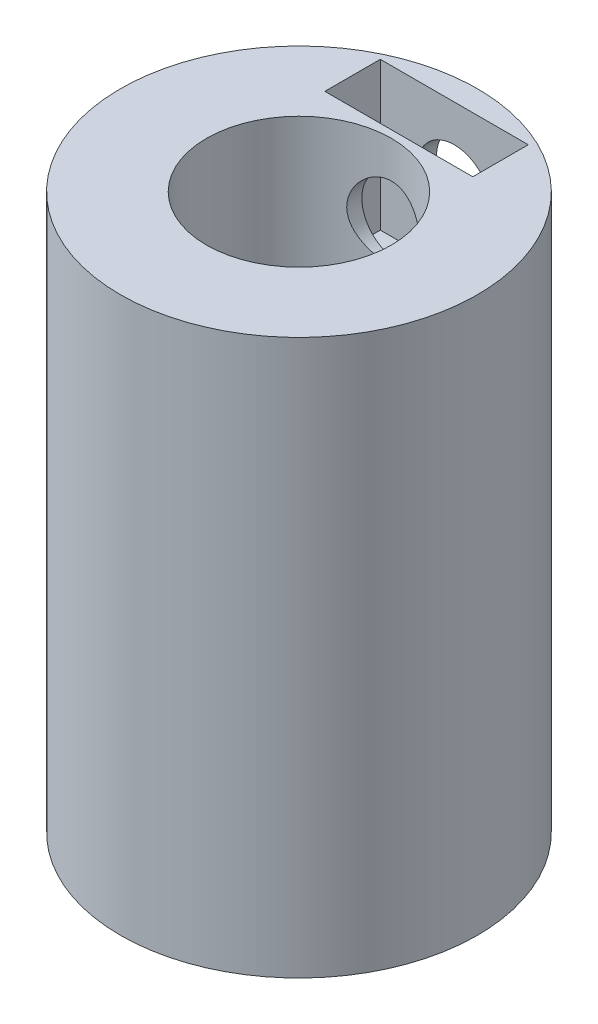
ISO-10303-21;
HEADER;
FILE_DESCRIPTION(('STEP AP214'),'2;1');
FILE_NAME('part.step','',(''),(''),'','','');
FILE_SCHEMA(('AUTOMOTIVE_DESIGN { 1 0 10303 214 1 1 1 1 }'));
ENDSEC;
DATA;
#1=APPLICATION_CONTEXT('core data for automotive mechanical design processes');
#2=APPLICATION_PROTOCOL_DEFINITION('international standard','automotive_design',2000,#1);
#3=PRODUCT_CONTEXT('',#1,'mechanical');
#4=PRODUCT('Part','Part','',(#3));
#5=PRODUCT_RELATED_PRODUCT_CATEGORY('part','',(#4));
#6=PRODUCT_DEFINITION_FORMATION('','',#4);
#7=PRODUCT_DEFINITION_CONTEXT('part definition',#1,'design');
#8=PRODUCT_DEFINITION('design','',#6,#7);
#9=PRODUCT_DEFINITION_SHAPE('','',#8);
#10=(LENGTH_UNIT() NAMED_UNIT(*) SI_UNIT(.MILLI.,.METRE.));
#11=(NAMED_UNIT(*) PLANE_ANGLE_UNIT() SI_UNIT($,.RADIAN.));
#12=(NAMED_UNIT(*) SI_UNIT($,.STERADIAN.) SOLID_ANGLE_UNIT());
#13=UNCERTAINTY_MEASURE_WITH_UNIT(LENGTH_MEASURE(1.E-05),#10,'distance_accuracy_value','');
#14=(GEOMETRIC_REPRESENTATION_CONTEXT(3) GLOBAL_UNCERTAINTY_ASSIGNED_CONTEXT((#13)) GLOBAL_UNIT_ASSIGNED_CONTEXT((#10,
#11,#12)) REPRESENTATION_CONTEXT('',''));
#15=CARTESIAN_POINT('',(0.,0.,0.));
#16=DIRECTION('',(0.,0.,1.));
#17=DIRECTION('',(1.,0.,0.));
#18=AXIS2_PLACEMENT_3D('',#15,#16,#17);
#19=CARTESIAN_POINT('',(0.,13.,-4.825));
#20=DIRECTION('',(0.,0.,1.));
#21=DIRECTION('',(1.,0.,0.));
#22=AXIS2_PLACEMENT_3D('',#19,#20,#21);
#23=CYLINDRICAL_SURFACE('',#22,1.);
#24=CARTESIAN_POINT('',(0.,13.,-4.2));
#25=DIRECTION('',(0.,0.,-1.));
#26=DIRECTION('',(-1.,0.,0.));
#27=AXIS2_PLACEMENT_3D('',#24,#25,#26);
#28=CIRCLE('',#27,1.);
#29=CARTESIAN_POINT('',(-1.,13.,-4.2));
#30=VERTEX_POINT('',#29);
#31=EDGE_CURVE('E39',#30,#30,#28,.F.);
#32=ORIENTED_EDGE('',*,*,#31,.T.);
#33=EDGE_LOOP('',(#32));
#34=FACE_BOUND('',#33,.T.);
#35=CARTESIAN_POINT('',(0.,14.,-4.825));
#36=CARTESIAN_POINT('',(-0.0555337749371979,13.9999980095426,-4.82499897232229));
#37=CARTESIAN_POINT('',(-0.111092283897824,13.9953583733151,-4.82403143982858));
#38=CARTESIAN_POINT('',(-0.220635978288691,13.976938857302,-4.82026513227892));
#39=CARTESIAN_POINT('',(-0.274619928267459,13.9631519915541,-4.81746495761164));
#40=CARTESIAN_POINT('',(-0.379415108317778,13.9268845622942,-4.81034570584005));
#41=CARTESIAN_POINT('',(-0.430229424061663,13.9044126121981,-4.80602813399493));
#42=CARTESIAN_POINT('',(-0.527363652308837,13.8514391753998,-4.79634217233464));
#43=CARTESIAN_POINT('',(-0.573683774704338,13.8209380639306,-4.79097383162887));
#44=CARTESIAN_POINT('',(-0.66118882945265,13.7523038631535,-4.77968915727681));
#45=CARTESIAN_POINT('',(-0.70229927625311,13.71407682074,-4.77376661341756));
#46=CARTESIAN_POINT('',(-0.777572700958549,13.6312777537565,-4.76208567849485));
#47=CARTESIAN_POINT('',(-0.811735108233673,13.5867052085525,-4.75632730094744));
#48=CARTESIAN_POINT('',(-0.872464127637685,13.491938951766,-4.74556583103651));
#49=CARTESIAN_POINT('',(-0.898952793857835,13.4416943036451,-4.74057071725844));
#50=CARTESIAN_POINT('',(-0.943082829331537,13.3373466215254,-4.7319899063046));
#51=CARTESIAN_POINT('',(-0.960725141279719,13.2832439993462,-4.72840405896187));
#52=CARTESIAN_POINT('',(-0.986418205693957,13.1735200779006,-4.72311078110287));
#53=CARTESIAN_POINT('',(-0.994600101140214,13.1179307506841,-4.72137769322457));
#54=CARTESIAN_POINT('',(-1.00154758529595,13.0061434774506,-4.71990900008838));
#55=CARTESIAN_POINT('',(-1.00031420971528,12.9499455990552,-4.72017317512518));
#56=CARTESIAN_POINT('',(-0.988572006339825,12.8395017364554,-4.72264587881794));
#57=CARTESIAN_POINT('',(-0.978214267277917,12.7852388732259,-4.72482273422336));
#58=CARTESIAN_POINT('',(-0.94875617560513,12.6792380999073,-4.73082557341371));
#59=CARTESIAN_POINT('',(-0.929655377773483,12.6275003185509,-4.73465164118052));
#60=CARTESIAN_POINT('',(-0.883111202109867,12.5275869708179,-4.74355374348232));
#61=CARTESIAN_POINT('',(-0.855608616209093,12.479439804795,-4.74863859893712));
#62=CARTESIAN_POINT('',(-0.793083281847362,12.3883874939458,-4.75947977569826));
#63=CARTESIAN_POINT('',(-0.758059608126641,12.3454829951032,-4.76523617958006));
#64=CARTESIAN_POINT('',(-0.680680795892922,12.26526282582,-4.77690857289816));
#65=CARTESIAN_POINT('',(-0.638196881592562,12.2280713946685,-4.78282549471707));
#66=CARTESIAN_POINT('',(-0.547529699441696,12.1613223607671,-4.79405042991448));
#67=CARTESIAN_POINT('',(-0.499346347785325,12.1317648702889,-4.79935843433706));
#68=CARTESIAN_POINT('',(-0.398504897019656,12.0810968725791,-4.80878202772954));
#69=CARTESIAN_POINT('',(-0.345839058309599,12.0600013500095,-4.81289549786507));
#70=CARTESIAN_POINT('',(-0.237606380637547,12.0269927900867,-4.8194506037445));
#71=CARTESIAN_POINT('',(-0.182039920574916,12.0150785565985,-4.82189245726136));
#72=CARTESIAN_POINT('',(-0.0706502226597532,12.0009484820516,-4.82479861824088));
#73=CARTESIAN_POINT('',(-0.0148494142784424,11.9985627371248,-4.82529756586335));
#74=CARTESIAN_POINT('',(0.0963534416632701,12.0030986795612,-4.82435823595497));
#75=CARTESIAN_POINT('',(0.151755513171417,12.0100198031935,-4.82292007575764));
#76=CARTESIAN_POINT('',(0.260034516615103,12.0328319522598,-4.81828986930337));
#77=CARTESIAN_POINT('',(0.31293076951785,12.0486350677419,-4.81511502012172));
#78=CARTESIAN_POINT('',(0.415322340559021,12.0886659743568,-4.80736633390397));
#79=CARTESIAN_POINT('',(0.464817389832119,12.112894430598,-4.80279238642451));
#80=CARTESIAN_POINT('',(0.559712858623476,12.1694506904338,-4.79266686365612));
#81=CARTESIAN_POINT('',(0.605051567319612,12.2018798518584,-4.78710333370338));
#82=CARTESIAN_POINT('',(0.689704614172722,12.2737821178334,-4.77564242429302));
#83=CARTESIAN_POINT('',(0.729018254208968,12.31325603751,-4.76974500625626));
#84=CARTESIAN_POINT('',(0.801167011131522,12.3989031849554,-4.7581631331559));
#85=CARTESIAN_POINT('',(0.833885092808699,12.4451758130553,-4.75248376803414));
#86=CARTESIAN_POINT('',(0.891085275537644,12.5426595618135,-4.74209243265639));
#87=CARTESIAN_POINT('',(0.91556771788,12.5938704777127,-4.73738042231571));
#88=CARTESIAN_POINT('',(0.955445684947046,12.6995115588836,-4.72949914952879));
#89=CARTESIAN_POINT('',(0.970890022525903,12.7539226511544,-4.72632161630158));
#90=CARTESIAN_POINT('',(0.992399663443535,12.8646411035235,-4.72185247284305));
#91=CARTESIAN_POINT('',(0.998466292676235,12.9209481944001,-4.72056059600427));
#92=CARTESIAN_POINT('',(1.00099642681495,13.0326834300154,-4.72002460070783));
#93=CARTESIAN_POINT('',(0.997645091285829,13.0881072745129,-4.72074099838088));
#94=CARTESIAN_POINT('',(0.981845074889641,13.1975825608294,-4.72405220687553));
#95=CARTESIAN_POINT('',(0.969396479413851,13.2516340155253,-4.7266470000656));
#96=CARTESIAN_POINT('',(0.935840546196696,13.3567013334055,-4.73340436836906));
#97=CARTESIAN_POINT('',(0.914757519304018,13.4077252627047,-4.73756253901071));
#98=CARTESIAN_POINT('',(0.86455312440675,13.5055401058013,-4.74698034065161));
#99=CARTESIAN_POINT('',(0.835431019575342,13.5523306310612,-4.7522400726045));
#100=CARTESIAN_POINT('',(0.769349624342363,13.6412690013137,-4.76338809043957));
#101=CARTESIAN_POINT('',(0.732257270740113,13.6833167824287,-4.76928607846646));
#102=CARTESIAN_POINT('',(0.65156115857222,13.7606522459155,-4.78097813532183));
#103=CARTESIAN_POINT('',(0.607955903415176,13.795938370269,-4.78677217992161));
#104=CARTESIAN_POINT('',(0.514874194602867,13.8591305059369,-4.7976815239039));
#105=CARTESIAN_POINT('',(0.465336525914121,13.8869478815579,-4.80278834085706));
#106=CARTESIAN_POINT('',(0.362196026608754,13.9338184083567,-4.8116637960917));
#107=CARTESIAN_POINT('',(0.308596813149679,13.9528792535601,-4.81543360848082));
#108=CARTESIAN_POINT('',(0.212417928224107,13.9781144531343,-4.82050031165034));
#109=CARTESIAN_POINT('',(0.170375980832123,13.9863065197244,-4.82217760474996));
#110=CARTESIAN_POINT('',(0.0855608989761687,13.9972499613381,-4.82442782480933));
#111=CARTESIAN_POINT('',(0.042787791077855,14.0000015336122,-4.82500079180749));
#112=CARTESIAN_POINT('',(0.,14.,-4.825));
#113=B_SPLINE_CURVE_WITH_KNOTS('',3,(#35,#36,#37,#38,#39,#40,#41,#42,#43,#44,#45,#46,#47,#48,
#49,#50,#51,#52,#53,#54,#55,#56,#57,#58,#59,#60,#61,#62,#63,#64,#65,#66,#67,#68,#69,#70,#71,#72,
#73,#74,#75,#76,#77,#78,#79,#80,#81,#82,#83,#84,#85,#86,#87,#88,#89,#90,#91,#92,#93,#94,#95,#96,
#97,#98,#99,#100,#101,#102,#103,#104,#105,#106,#107,#108,#109,#110,#111,#112),.UNSPECIFIED.,.T.,
.F.,(4,2,2,2,2,2,2,2,2,2,2,2,2,2,2,2,2,2,2,2,2,2,2,2,2,2,2,2,2,2,2,2,2,2,2,2,2,2,4),(0.,
0.166444760862771,0.333016786199508,0.499424036207241,0.665823510756181,0.834383552876869,
1.00295743294218,1.17318794905826,1.34340032103152,1.51122375025569,1.67902871863321,
1.84410619074715,2.00919206999852,2.17546926221556,2.34176692192708,2.51128315361609,
2.6808018782215,2.85061947942033,3.02041495310222,3.18716888868519,3.35391272418647,
3.51903455305692,3.68416941983684,3.85145459785574,4.01875914446696,4.18881208614787,
4.35885797984892,4.52797680834565,4.69707172330877,4.86286557789211,5.02865787627425,
5.19398654935727,5.35933038077949,5.52768524685288,5.69607885866566,5.86639044209173,
6.03655209172551,6.16479948502689,6.29304222850784),.UNSPECIFIED.);
#114=CARTESIAN_POINT('',(0.,14.,-4.825));
#115=VERTEX_POINT('',#114);
#116=EDGE_CURVE('E117',#115,#115,#113,.T.);
#117=ORIENTED_EDGE('',*,*,#116,.F.);
#118=EDGE_LOOP('',(#117));
#119=FACE_BOUND('',#118,.T.);
#120=ADVANCED_FACE('F34',(#34,#119),#23,.F.);
#121=CARTESIAN_POINT('',(0.,15.,0.));
#122=DIRECTION('',(0.,-1.,0.));
#123=DIRECTION('',(0.,0.,-1.));
#124=AXIS2_PLACEMENT_3D('',#121,#122,#123);
#125=CYLINDRICAL_SURFACE('',#124,4.825);
#126=ORIENTED_EDGE('',*,*,#116,.T.);
#127=EDGE_LOOP('',(#126));
#128=FACE_BOUND('',#127,.T.);
#129=CARTESIAN_POINT('',(0.,15.,0.));
#130=DIRECTION('',(0.,1.,0.));
#131=DIRECTION('',(0.,0.,1.));
#132=AXIS2_PLACEMENT_3D('',#129,#130,#131);
#133=CIRCLE('',#132,4.825);
#134=CARTESIAN_POINT('',(0.,15.,4.825));
#135=VERTEX_POINT('',#134);
#136=EDGE_CURVE('E11',#135,#135,#133,.T.);
#137=ORIENTED_EDGE('',*,*,#136,.F.);
#138=EDGE_LOOP('',(#137));
#139=FACE_BOUND('',#138,.T.);
#140=CARTESIAN_POINT('',(0.,0.,0.));
#141=DIRECTION('',(0.,1.,0.));
#142=DIRECTION('',(0.,0.,1.));
#143=AXIS2_PLACEMENT_3D('',#140,#141,#142);
#144=CIRCLE('',#143,4.825);
#145=CARTESIAN_POINT('',(0.,0.,4.825));
#146=VERTEX_POINT('',#145);
#147=EDGE_CURVE('E44',#146,#146,#144,.T.);
#148=ORIENTED_EDGE('',*,*,#147,.T.);
#149=EDGE_LOOP('',(#148));
#150=FACE_BOUND('',#149,.T.);
#151=ADVANCED_FACE('F36',(#128,#139,#150),#125,.T.);
#152=CARTESIAN_POINT('',(0.,15.,0.));
#153=DIRECTION('',(0.,1.,0.));
#154=DIRECTION('',(0.,0.,1.));
#155=AXIS2_PLACEMENT_3D('',#152,#153,#154);
#156=PLANE('',#155);
#157=DIRECTION('',(0.,0.,1.));
#158=VECTOR('',#157,1.);
#159=CARTESIAN_POINT('',(-2.,15.,-4.2));
#160=LINE('',#159,#158);
#161=CARTESIAN_POINT('',(-2.,15.,-4.2));
#162=VERTEX_POINT('',#161);
#163=CARTESIAN_POINT('',(-2.,15.,-2.7));
#164=VERTEX_POINT('',#163);
#165=EDGE_CURVE('E52',#162,#164,#160,.T.);
#166=ORIENTED_EDGE('',*,*,#165,.F.);
#167=DIRECTION('',(-1.,0.,0.));
#168=VECTOR('',#167,1.);
#169=CARTESIAN_POINT('',(-2.,15.,-4.2));
#170=LINE('',#169,#168);
#171=CARTESIAN_POINT('',(2.,15.,-4.2));
#172=VERTEX_POINT('',#171);
#173=EDGE_CURVE('E104',#172,#162,#170,.T.);
#174=ORIENTED_EDGE('',*,*,#173,.F.);
#175=DIRECTION('',(0.,0.,-1.));
#176=VECTOR('',#175,1.);
#177=CARTESIAN_POINT('',(2.,15.,-4.2));
#178=LINE('',#177,#176);
#179=CARTESIAN_POINT('',(2.,15.,-2.7));
#180=VERTEX_POINT('',#179);
#181=EDGE_CURVE('E110',#180,#172,#178,.T.);
#182=ORIENTED_EDGE('',*,*,#181,.F.);
#183=DIRECTION('',(1.,0.,0.));
#184=VECTOR('',#183,1.);
#185=CARTESIAN_POINT('',(-2.,15.,-2.7));
#186=LINE('',#185,#184);
#187=EDGE_CURVE('E88',#164,#180,#186,.T.);
#188=ORIENTED_EDGE('',*,*,#187,.F.);
#189=EDGE_LOOP('',(#166,#174,#182,#188));
#190=FACE_BOUND('',#189,.T.);
#191=CARTESIAN_POINT('',(0.,15.,0.));
#192=DIRECTION('',(0.,1.,0.));
#193=DIRECTION('',(0.,0.,1.));
#194=AXIS2_PLACEMENT_3D('',#191,#192,#193);
#195=CIRCLE('',#194,2.5);
#196=CARTESIAN_POINT('',(0.,15.,2.5));
#197=VERTEX_POINT('',#196);
#198=EDGE_CURVE('E124',#197,#197,#195,.T.);
#199=ORIENTED_EDGE('',*,*,#198,.F.);
#200=EDGE_LOOP('',(#199));
#201=FACE_BOUND('',#200,.T.);
#202=ORIENTED_EDGE('',*,*,#136,.T.);
#203=EDGE_LOOP('',(#202));
#204=FACE_BOUND('',#203,.T.);
#205=ADVANCED_FACE('F160',(#190,#201,#204),#156,.T.);
#206=CARTESIAN_POINT('',(0.,0.,0.));
#207=DIRECTION('',(0.,1.,0.));
#208=DIRECTION('',(0.,0.,1.));
#209=AXIS2_PLACEMENT_3D('',#206,#207,#208);
#210=PLANE('',#209);
#211=CARTESIAN_POINT('',(0.,0.,0.));
#212=DIRECTION('',(0.,1.,0.));
#213=DIRECTION('',(0.,0.,1.));
#214=AXIS2_PLACEMENT_3D('',#211,#212,#213);
#215=CIRCLE('',#214,2.5);
#216=CARTESIAN_POINT('',(0.,0.,2.5));
#217=VERTEX_POINT('',#216);
#218=EDGE_CURVE('E186',#217,#217,#215,.T.);
#219=ORIENTED_EDGE('',*,*,#218,.T.);
#220=EDGE_LOOP('',(#219));
#221=FACE_BOUND('',#220,.T.);
#222=ORIENTED_EDGE('',*,*,#147,.F.);
#223=EDGE_LOOP('',(#222));
#224=FACE_BOUND('',#223,.T.);
#225=ADVANCED_FACE('F158',(#221,#224),#210,.F.);
#226=CARTESIAN_POINT('',(0.,3.,0.));
#227=DIRECTION('',(0.,-1.,0.));
#228=DIRECTION('',(0.,0.,-1.));
#229=AXIS2_PLACEMENT_3D('',#226,#227,#228);
#230=CYLINDRICAL_SURFACE('',#229,2.5);
#231=CARTESIAN_POINT('',(0.,3.,0.));
#232=DIRECTION('',(0.,1.,0.));
#233=DIRECTION('',(0.,0.,1.));
#234=AXIS2_PLACEMENT_3D('',#231,#232,#233);
#235=CIRCLE('',#234,2.5);
#236=CARTESIAN_POINT('',(0.,3.,2.5));
#237=VERTEX_POINT('',#236);
#238=EDGE_CURVE('E184',#237,#237,#235,.T.);
#239=ORIENTED_EDGE('',*,*,#238,.T.);
#240=EDGE_LOOP('',(#239));
#241=FACE_BOUND('',#240,.T.);
#242=ORIENTED_EDGE('',*,*,#218,.F.);
#243=EDGE_LOOP('',(#242));
#244=FACE_BOUND('',#243,.T.);
#245=ADVANCED_FACE('F154',(#241,#244),#230,.F.);
#246=CARTESIAN_POINT('',(0.,3.,0.));
#247=DIRECTION('',(0.,1.,0.));
#248=DIRECTION('',(0.,0.,1.));
#249=AXIS2_PLACEMENT_3D('',#246,#247,#248);
#250=PLANE('',#249);
#251=ORIENTED_EDGE('',*,*,#238,.F.);
#252=EDGE_LOOP('',(#251));
#253=FACE_BOUND('',#252,.T.);
#254=ADVANCED_FACE('F150',(#253),#250,.F.);
#255=CARTESIAN_POINT('',(0.,10.,0.));
#256=DIRECTION('',(0.,1.,0.));
#257=DIRECTION('',(0.,0.,1.));
#258=AXIS2_PLACEMENT_3D('',#255,#256,#257);
#259=CYLINDRICAL_SURFACE('',#258,2.5);
#260=CARTESIAN_POINT('',(1.,13.,-2.29128784747792));
#261=CARTESIAN_POINT('',(0.999994127101895,12.9464302509501,-2.29129325828211));
#262=CARTESIAN_POINT('',(0.995669909297177,12.8927847326476,-2.29319301242133));
#263=CARTESIAN_POINT('',(0.978534515296366,12.7870325835615,-2.30055457093922));
#264=CARTESIAN_POINT('',(0.965701652221066,12.7349302414598,-2.30602547693426));
#265=CARTESIAN_POINT('',(0.932117516284353,12.633973529015,-2.31980227895648));
#266=CARTESIAN_POINT('',(0.911396076262713,12.5851077263199,-2.32809748178557));
#267=CARTESIAN_POINT('',(0.862710134685806,12.4915574745702,-2.3465733254764));
#268=CARTESIAN_POINT('',(0.83474721463375,12.4468721154246,-2.35675355451961));
#269=CARTESIAN_POINT('',(0.770660987293711,12.3603697988793,-2.37850432525516));
#270=CARTESIAN_POINT('',(0.734189678863665,12.3188217885353,-2.39011958979373));
#271=CARTESIAN_POINT('',(0.654854552887024,12.2422355013423,-2.41306228489405));
#272=CARTESIAN_POINT('',(0.611988510837841,12.2071994993551,-2.42438961368186));
#273=CARTESIAN_POINT('',(0.51900315517819,12.1432968015086,-2.44601703953427));
#274=CARTESIAN_POINT('',(0.468664482806142,12.1147278492647,-2.45625901841784));
#275=CARTESIAN_POINT('',(0.363412661437561,12.0665782158051,-2.47401963815773));
#276=CARTESIAN_POINT('',(0.308501384643982,12.046993877109,-2.48153938692337));
#277=CARTESIAN_POINT('',(0.198483213419447,12.0183292567813,-2.49269162504142));
#278=CARTESIAN_POINT('',(0.143514492402304,12.0087863429555,-2.49649468387678));
#279=CARTESIAN_POINT('',(0.0326331643188264,11.9989857571687,-2.50040155341352));
#280=CARTESIAN_POINT('',(-0.0232790829127005,11.9987246220326,-2.50050674384656));
#281=CARTESIAN_POINT('',(-0.131116247357655,12.0072413848875,-2.49710981410893));
#282=CARTESIAN_POINT('',(-0.183088726437016,12.0155123863735,-2.49380998385918));
#283=CARTESIAN_POINT('',(-0.284836554609168,12.0399964381554,-2.48424645734395));
#284=CARTESIAN_POINT('',(-0.334611742195079,12.0562100712002,-2.47798254360556));
#285=CARTESIAN_POINT('',(-0.431448969255827,12.0963182414382,-2.4629841222885));
#286=CARTESIAN_POINT('',(-0.478458811689817,12.1203248574078,-2.454213802334));
#287=CARTESIAN_POINT('',(-0.567904075370287,12.1752325034595,-2.43507292589849));
#288=CARTESIAN_POINT('',(-0.610337921358054,12.2061358965488,-2.42470182132537));
#289=CARTESIAN_POINT('',(-0.692384413996076,12.2763245679733,-2.40260818589167));
#290=CARTESIAN_POINT('',(-0.731628922636821,12.3160269462919,-2.3908416326012));
#291=CARTESIAN_POINT('',(-0.803053707692663,12.4014952859105,-2.36780830482389));
#292=CARTESIAN_POINT('',(-0.835231671879829,12.4472632240771,-2.35654169488173));
#293=CARTESIAN_POINT('',(-0.892452094371466,12.5452095112045,-2.33548448720906));
#294=CARTESIAN_POINT('',(-0.917267325867452,12.5975324152419,-2.3257445709069));
#295=CARTESIAN_POINT('',(-0.957588129983133,12.706107745231,-2.30943795233662));
#296=CARTESIAN_POINT('',(-0.9730997492022,12.7623575923854,-2.3028691896167));
#297=CARTESIAN_POINT('',(-0.993477474415979,12.873517888718,-2.29414879836282));
#298=CARTESIAN_POINT('',(-0.998936048404205,12.9283002235601,-2.29175183224038));
#299=CARTESIAN_POINT('',(-1.00078066322451,13.038038603884,-2.29094748938549));
#300=CARTESIAN_POINT('',(-0.997169455296442,13.0929945916389,-2.29253890281231));
#301=CARTESIAN_POINT('',(-0.981516447394263,13.1982294674774,-2.29928022178566));
#302=CARTESIAN_POINT('',(-0.969966531011729,13.2485964686998,-2.30422228898885));
#303=CARTESIAN_POINT('',(-0.939402093455639,13.346644202393,-2.31685025513936));
#304=CARTESIAN_POINT('',(-0.920385917151197,13.3943243365537,-2.32453676244372));
#305=CARTESIAN_POINT('',(-0.874567819740728,13.4878011788977,-2.34216890929975));
#306=CARTESIAN_POINT('',(-0.847481434132298,13.5334430943472,-2.35219352319567));
#307=CARTESIAN_POINT('',(-0.786582612220938,13.6197414937208,-2.37325192578919));
#308=CARTESIAN_POINT('',(-0.752767436740993,13.6603959363978,-2.38428612448031));
#309=CARTESIAN_POINT('',(-0.676422105840243,13.7386867042996,-2.40710457985699));
#310=CARTESIAN_POINT('',(-0.63343271472255,13.7758782826455,-2.41888403642601));
#311=CARTESIAN_POINT('',(-0.541541816684423,13.8425885383052,-2.44109897283781));
#312=CARTESIAN_POINT('',(-0.492640069233933,13.8721069032986,-2.4515343979662));
#313=CARTESIAN_POINT('',(-0.390139967000881,13.9225238132306,-2.46991857950143));
#314=CARTESIAN_POINT('',(-0.336542740497034,13.9434244220829,-2.47786793120137));
#315=CARTESIAN_POINT('',(-0.226196795459614,13.9757744262038,-2.49036356734645));
#316=CARTESIAN_POINT('',(-0.169449805147136,13.98722895072,-2.49491169853772));
#317=CARTESIAN_POINT('',(-0.0584082551731527,13.9997523508127,-2.49989504105256));
#318=CARTESIAN_POINT('',(-0.00419524629652882,14.0014500642313,-2.50057923372437));
#319=CARTESIAN_POINT('',(0.103716917866621,13.9960722603579,-2.49843021189296));
#320=CARTESIAN_POINT('',(0.15741614969731,13.9889980711072,-2.49559752983456));
#321=CARTESIAN_POINT('',(0.261085450973205,13.9667266058208,-2.48685756682127));
#322=CARTESIAN_POINT('',(0.311119402324193,13.9517855269622,-2.48104740317165));
#323=CARTESIAN_POINT('',(0.40796117737947,13.9144735977191,-2.46697473916019));
#324=CARTESIAN_POINT('',(0.454768404133638,13.8921013769898,-2.45871178652006));
#325=CARTESIAN_POINT('',(0.546101520928058,13.8394484007553,-2.44009047180029));
#326=CARTESIAN_POINT('',(0.590435193403213,13.8088618525575,-2.42965564864115));
#327=CARTESIAN_POINT('',(0.673527014262037,13.7411057404105,-2.40794701593224));
#328=CARTESIAN_POINT('',(0.712282842872878,13.7039334517699,-2.3966728602525));
#329=CARTESIAN_POINT('',(0.785600632542996,13.6213423877375,-2.37368881779711));
#330=CARTESIAN_POINT('',(0.819754443599514,13.5755555632994,-2.36199516302692));
#331=CARTESIAN_POINT('',(0.879923725219699,13.4785289312856,-2.3402483573759));
#332=CARTESIAN_POINT('',(0.905938238949994,13.4272884835451,-2.33019539943728));
#333=CARTESIAN_POINT('',(0.946995543836655,13.325481399076,-2.31379432228954));
#334=CARTESIAN_POINT('',(0.962813757082104,13.2752673826244,-2.30719459305824));
#335=CARTESIAN_POINT('',(0.986358878909193,13.1727572901848,-2.29723001801982));
#336=CARTESIAN_POINT('',(0.994108333944008,13.1204674420165,-2.29385616036088));
#337=CARTESIAN_POINT('',(0.999232129155087,13.045311218831,-2.29162229378817));
#338=CARTESIAN_POINT('',(1.00000248449744,13.0226623895012,-2.29128555846679));
#339=CARTESIAN_POINT('',(1.,13.,-2.29128784747792));
#340=B_SPLINE_CURVE_WITH_KNOTS('',3,(#260,#261,#262,#263,#264,#265,#266,#267,#268,#269,#270,
#271,#272,#273,#274,#275,#276,#277,#278,#279,#280,#281,#282,#283,#284,#285,#286,#287,#288,#289,
#290,#291,#292,#293,#294,#295,#296,#297,#298,#299,#300,#301,#302,#303,#304,#305,#306,#307,#308,
#309,#310,#311,#312,#313,#314,#315,#316,#317,#318,#319,#320,#321,#322,#323,#324,#325,#326,#327,
#328,#329,#330,#331,#332,#333,#334,#335,#336,#337,#338,#339),.UNSPECIFIED.,.T.,.F.,(4,2,2,2,2,2,
2,2,2,2,2,2,2,2,2,2,2,2,2,2,2,2,2,2,2,2,2,2,2,2,2,2,2,2,2,2,2,2,2,4),(0.,0.160638824383827,
0.321688667911123,0.482135411646695,0.642547144119308,0.811278091422121,0.980067871741711,
1.15551334545714,1.3308873348474,1.49777091443592,1.66459222652836,1.82204322415151,
1.9795057756453,2.13934150117449,2.29923207470016,2.46962022040678,2.64006403563564,
2.81532229357288,2.99046652397056,3.15491073759215,3.31930507450975,3.47433624039578,
3.62940179322824,3.79075577323356,3.9521755725993,4.12551867120495,4.29886882423379,
4.47217743653411,4.64539187974073,4.80730519874982,4.96919400753306,5.12610997218681,
5.28305488911298,5.44693525566968,5.61088358279108,5.78498126639812,5.959099408766,
6.11758330406543,6.27562315106628,6.34358052760367),.UNSPECIFIED.);
#341=CARTESIAN_POINT('',(1.,13.,-2.29128784747792));
#342=VERTEX_POINT('',#341);
#343=EDGE_CURVE('E125',#342,#342,#340,.T.);
#344=ORIENTED_EDGE('',*,*,#343,.T.);
#345=EDGE_LOOP('',(#344));
#346=FACE_BOUND('',#345,.T.);
#347=CARTESIAN_POINT('',(0.,10.,0.));
#348=DIRECTION('',(0.,1.,0.));
#349=DIRECTION('',(0.,0.,1.));
#350=AXIS2_PLACEMENT_3D('',#347,#348,#349);
#351=CIRCLE('',#350,2.5);
#352=CARTESIAN_POINT('',(0.,10.,2.5));
#353=VERTEX_POINT('',#352);
#354=EDGE_CURVE('E126',#353,#353,#351,.T.);
#355=ORIENTED_EDGE('',*,*,#354,.F.);
#356=EDGE_LOOP('',(#355));
#357=FACE_BOUND('',#356,.T.);
#358=ORIENTED_EDGE('',*,*,#198,.T.);
#359=EDGE_LOOP('',(#358));
#360=FACE_BOUND('',#359,.T.);
#361=ADVANCED_FACE('F146',(#346,#357,#360),#259,.F.);
#362=CARTESIAN_POINT('',(0.,10.,0.));
#363=DIRECTION('',(0.,1.,0.));
#364=DIRECTION('',(0.,0.,1.));
#365=AXIS2_PLACEMENT_3D('',#362,#363,#364);
#366=PLANE('',#365);
#367=ORIENTED_EDGE('',*,*,#354,.T.);
#368=EDGE_LOOP('',(#367));
#369=FACE_BOUND('',#368,.T.);
#370=ADVANCED_FACE('F134',(#369),#366,.T.);
#371=CARTESIAN_POINT('',(0.,13.,-2.7));
#372=DIRECTION('',(0.,0.,1.));
#373=DIRECTION('',(1.,0.,0.));
#374=AXIS2_PLACEMENT_3D('',#371,#372,#373);
#375=CIRCLE('',#374,1.);
#376=CARTESIAN_POINT('',(1.,13.,-2.7));
#377=VERTEX_POINT('',#376);
#378=EDGE_CURVE('E114',#377,#377,#375,.F.);
#379=ORIENTED_EDGE('',*,*,#378,.T.);
#380=EDGE_LOOP('',(#379));
#381=FACE_BOUND('',#380,.T.);
#382=ORIENTED_EDGE('',*,*,#343,.F.);
#383=EDGE_LOOP('',(#382));
#384=FACE_BOUND('',#383,.T.);
#385=ADVANCED_FACE('F128',(#381,#384),#23,.F.);
#386=CARTESIAN_POINT('',(-2.,11.,-4.2));
#387=DIRECTION('',(0.,0.,-1.));
#388=DIRECTION('',(-1.,0.,0.));
#389=AXIS2_PLACEMENT_3D('',#386,#387,#388);
#390=PLANE('',#389);
#391=ORIENTED_EDGE('',*,*,#173,.T.);
#392=DIRECTION('',(0.,1.,0.));
#393=VECTOR('',#392,1.);
#394=CARTESIAN_POINT('',(-2.,11.,-4.2));
#395=LINE('',#394,#393);
#396=CARTESIAN_POINT('',(-2.,11.,-4.2));
#397=VERTEX_POINT('',#396);
#398=EDGE_CURVE('E60',#397,#162,#395,.T.);
#399=ORIENTED_EDGE('',*,*,#398,.F.);
#400=DIRECTION('',(-1.,0.,0.));
#401=VECTOR('',#400,1.);
#402=CARTESIAN_POINT('',(-2.,11.,-4.2));
#403=LINE('',#402,#401);
#404=CARTESIAN_POINT('',(2.,11.,-4.2));
#405=VERTEX_POINT('',#404);
#406=EDGE_CURVE('E99',#405,#397,#403,.T.);
#407=ORIENTED_EDGE('',*,*,#406,.F.);
#408=DIRECTION('',(0.,1.,0.));
#409=VECTOR('',#408,1.);
#410=CARTESIAN_POINT('',(2.,11.,-4.2));
#411=LINE('',#410,#409);
#412=EDGE_CURVE('E92',#405,#172,#411,.T.);
#413=ORIENTED_EDGE('',*,*,#412,.T.);
#414=EDGE_LOOP('',(#391,#399,#407,#413));
#415=FACE_BOUND('',#414,.T.);
#416=ORIENTED_EDGE('',*,*,#31,.F.);
#417=EDGE_LOOP('',(#416));
#418=FACE_BOUND('',#417,.T.);
#419=ADVANCED_FACE('F133',(#415,#418),#390,.F.);
#420=CARTESIAN_POINT('',(-2.,11.,-2.7));
#421=DIRECTION('',(0.,0.,1.));
#422=DIRECTION('',(1.,0.,0.));
#423=AXIS2_PLACEMENT_3D('',#420,#421,#422);
#424=PLANE('',#423);
#425=ORIENTED_EDGE('',*,*,#187,.T.);
#426=DIRECTION('',(0.,1.,0.));
#427=VECTOR('',#426,1.);
#428=CARTESIAN_POINT('',(2.,11.,-2.7));
#429=LINE('',#428,#427);
#430=CARTESIAN_POINT('',(2.,11.,-2.7));
#431=VERTEX_POINT('',#430);
#432=EDGE_CURVE('E80',#431,#180,#429,.T.);
#433=ORIENTED_EDGE('',*,*,#432,.F.);
#434=DIRECTION('',(1.,0.,0.));
#435=VECTOR('',#434,1.);
#436=CARTESIAN_POINT('',(-2.,11.,-2.7));
#437=LINE('',#436,#435);
#438=CARTESIAN_POINT('',(-2.,11.,-2.7));
#439=VERTEX_POINT('',#438);
#440=EDGE_CURVE('E85',#439,#431,#437,.T.);
#441=ORIENTED_EDGE('',*,*,#440,.F.);
#442=DIRECTION('',(0.,1.,0.));
#443=VECTOR('',#442,1.);
#444=CARTESIAN_POINT('',(-2.,11.,-2.7));
#445=LINE('',#444,#443);
#446=EDGE_CURVE('E75',#439,#164,#445,.T.);
#447=ORIENTED_EDGE('',*,*,#446,.T.);
#448=EDGE_LOOP('',(#425,#433,#441,#447));
#449=FACE_BOUND('',#448,.T.);
#450=ORIENTED_EDGE('',*,*,#378,.F.);
#451=EDGE_LOOP('',(#450));
#452=FACE_BOUND('',#451,.T.);
#453=ADVANCED_FACE('F82',(#449,#452),#424,.F.);
#454=CARTESIAN_POINT('',(-2.,11.,-4.2));
#455=DIRECTION('',(-1.,0.,0.));
#456=DIRECTION('',(0.,0.,1.));
#457=AXIS2_PLACEMENT_3D('',#454,#455,#456);
#458=PLANE('',#457);
#459=ORIENTED_EDGE('',*,*,#165,.T.);
#460=ORIENTED_EDGE('',*,*,#446,.F.);
#461=DIRECTION('',(0.,0.,1.));
#462=VECTOR('',#461,1.);
#463=CARTESIAN_POINT('',(-2.,11.,-4.2));
#464=LINE('',#463,#462);
#465=EDGE_CURVE('E102',#397,#439,#464,.T.);
#466=ORIENTED_EDGE('',*,*,#465,.F.);
#467=ORIENTED_EDGE('',*,*,#398,.T.);
#468=EDGE_LOOP('',(#459,#460,#466,#467));
#469=FACE_BOUND('',#468,.T.);
#470=ADVANCED_FACE('F136',(#469),#458,.F.);
#471=CARTESIAN_POINT('',(2.,11.,-4.2));
#472=DIRECTION('',(1.,0.,0.));
#473=DIRECTION('',(0.,0.,-1.));
#474=AXIS2_PLACEMENT_3D('',#471,#472,#473);
#475=PLANE('',#474);
#476=ORIENTED_EDGE('',*,*,#181,.T.);
#477=ORIENTED_EDGE('',*,*,#412,.F.);
#478=DIRECTION('',(0.,0.,-1.));
#479=VECTOR('',#478,1.);
#480=CARTESIAN_POINT('',(2.,11.,-4.2));
#481=LINE('',#480,#479);
#482=EDGE_CURVE('E95',#431,#405,#481,.T.);
#483=ORIENTED_EDGE('',*,*,#482,.F.);
#484=ORIENTED_EDGE('',*,*,#432,.T.);
#485=EDGE_LOOP('',(#476,#477,#483,#484));
#486=FACE_BOUND('',#485,.T.);
#487=ADVANCED_FACE('F96',(#486),#475,.F.);
#488=CARTESIAN_POINT('',(0.,11.,0.));
#489=DIRECTION('',(0.,1.,0.));
#490=DIRECTION('',(0.,0.,1.));
#491=AXIS2_PLACEMENT_3D('',#488,#489,#490);
#492=PLANE('',#491);
#493=ORIENTED_EDGE('',*,*,#465,.T.);
#494=ORIENTED_EDGE('',*,*,#440,.T.);
#495=ORIENTED_EDGE('',*,*,#482,.T.);
#496=ORIENTED_EDGE('',*,*,#406,.T.);
#497=EDGE_LOOP('',(#493,#494,#495,#496));
#498=FACE_BOUND('',#497,.T.);
#499=ADVANCED_FACE('F101',(#498),#492,.T.);
#500=CLOSED_SHELL('',(#120,#151,#205,#225,#245,#254,#361,#370,#385,#419,#453,#470,#487,#499));
#501=MANIFOLD_SOLID_BREP('B2',#500);
#502=ADVANCED_BREP_SHAPE_REPRESENTATION('',(#18,#501),#14);
#503=SHAPE_DEFINITION_REPRESENTATION(#9,#502);
ENDSEC;
END-ISO-10303-21;
